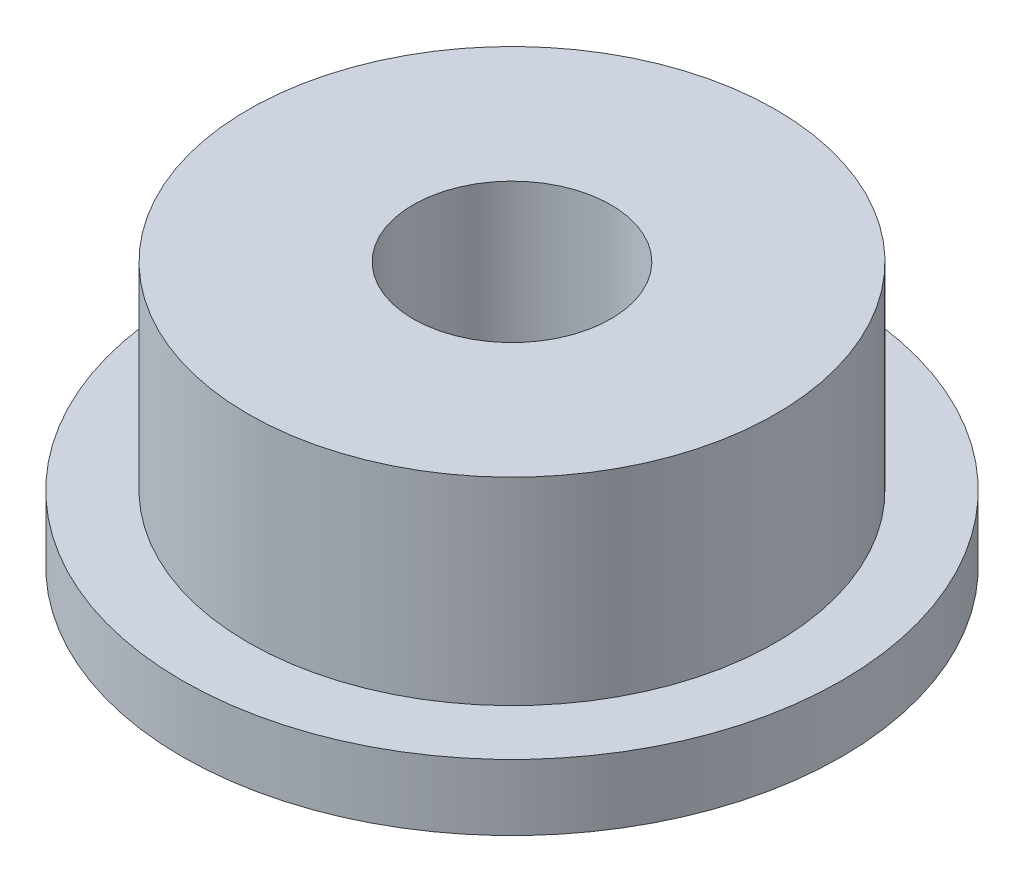
ISO-10303-21;
HEADER;
FILE_DESCRIPTION(('STEP AP214'),'2;1');
FILE_NAME('part.step','',(''),(''),'','','');
FILE_SCHEMA(('AUTOMOTIVE_DESIGN { 1 0 10303 214 1 1 1 1 }'));
ENDSEC;
DATA;
#1=APPLICATION_CONTEXT('core data for automotive mechanical design processes');
#2=APPLICATION_PROTOCOL_DEFINITION('international standard','automotive_design',2000,#1);
#3=PRODUCT_CONTEXT('',#1,'mechanical');
#4=PRODUCT('Part','Part','',(#3));
#5=PRODUCT_RELATED_PRODUCT_CATEGORY('part','',(#4));
#6=PRODUCT_DEFINITION_FORMATION('','',#4);
#7=PRODUCT_DEFINITION_CONTEXT('part definition',#1,'design');
#8=PRODUCT_DEFINITION('design','',#6,#7);
#9=PRODUCT_DEFINITION_SHAPE('','',#8);
#10=(LENGTH_UNIT() NAMED_UNIT(*) SI_UNIT(.MILLI.,.METRE.));
#11=(NAMED_UNIT(*) PLANE_ANGLE_UNIT() SI_UNIT($,.RADIAN.));
#12=(NAMED_UNIT(*) SI_UNIT($,.STERADIAN.) SOLID_ANGLE_UNIT());
#13=UNCERTAINTY_MEASURE_WITH_UNIT(LENGTH_MEASURE(1.E-05),#10,'distance_accuracy_value','');
#14=(GEOMETRIC_REPRESENTATION_CONTEXT(3) GLOBAL_UNCERTAINTY_ASSIGNED_CONTEXT((#13)) GLOBAL_UNIT_ASSIGNED_CONTEXT((#10,
#11,#12)) REPRESENTATION_CONTEXT('',''));
#15=CARTESIAN_POINT('',(0.,0.,0.));
#16=DIRECTION('',(0.,0.,1.));
#17=DIRECTION('',(1.,0.,0.));
#18=AXIS2_PLACEMENT_3D('',#15,#16,#17);
#19=CARTESIAN_POINT('',(1.5,0.,0.));
#20=DIRECTION('',(0.,-1.,0.));
#21=DIRECTION('',(0.,0.,-1.));
#22=AXIS2_PLACEMENT_3D('',#19,#20,#21);
#23=PLANE('',#22);
#24=CARTESIAN_POINT('',(0.,0.,0.));
#25=DIRECTION('',(0.,1.,0.));
#26=DIRECTION('',(0.,0.,1.));
#27=AXIS2_PLACEMENT_3D('',#24,#25,#26);
#28=CIRCLE('',#27,1.5);
#29=CARTESIAN_POINT('',(0.,0.,1.5));
#30=VERTEX_POINT('',#29);
#31=EDGE_CURVE('E67',#30,#30,#28,.T.);
#32=ORIENTED_EDGE('',*,*,#31,.F.);
#33=EDGE_LOOP('',(#32));
#34=FACE_BOUND('',#33,.T.);
#35=CARTESIAN_POINT('',(0.,0.,0.));
#36=DIRECTION('',(0.,1.,0.));
#37=DIRECTION('',(0.,0.,1.));
#38=AXIS2_PLACEMENT_3D('',#35,#36,#37);
#39=CIRCLE('',#38,4.);
#40=CARTESIAN_POINT('',(0.,0.,4.));
#41=VERTEX_POINT('',#40);
#42=EDGE_CURVE('E10',#41,#41,#39,.T.);
#43=ORIENTED_EDGE('',*,*,#42,.T.);
#44=EDGE_LOOP('',(#43));
#45=FACE_BOUND('',#44,.T.);
#46=ADVANCED_FACE('F39',(#34,#45),#23,.F.);
#47=CARTESIAN_POINT('',(0.,0.,0.));
#48=DIRECTION('',(0.,1.,0.));
#49=DIRECTION('',(0.,0.,1.));
#50=AXIS2_PLACEMENT_3D('',#47,#48,#49);
#51=CYLINDRICAL_SURFACE('',#50,4.);
#52=ORIENTED_EDGE('',*,*,#42,.F.);
#53=EDGE_LOOP('',(#52));
#54=FACE_BOUND('',#53,.T.);
#55=CARTESIAN_POINT('',(0.,-3.,0.));
#56=DIRECTION('',(0.,1.,0.));
#57=DIRECTION('',(0.,0.,1.));
#58=AXIS2_PLACEMENT_3D('',#55,#56,#57);
#59=CIRCLE('',#58,4.);
#60=CARTESIAN_POINT('',(0.,-3.,4.));
#61=VERTEX_POINT('',#60);
#62=EDGE_CURVE('E46',#61,#61,#59,.T.);
#63=ORIENTED_EDGE('',*,*,#62,.T.);
#64=EDGE_LOOP('',(#63));
#65=FACE_BOUND('',#64,.T.);
#66=ADVANCED_FACE('F74',(#54,#65),#51,.T.);
#67=CARTESIAN_POINT('',(4.,-3.,0.));
#68=DIRECTION('',(0.,-1.,0.));
#69=DIRECTION('',(0.,0.,-1.));
#70=AXIS2_PLACEMENT_3D('',#67,#68,#69);
#71=PLANE('',#70);
#72=ORIENTED_EDGE('',*,*,#62,.F.);
#73=EDGE_LOOP('',(#72));
#74=FACE_BOUND('',#73,.T.);
#75=CARTESIAN_POINT('',(0.,-3.,0.));
#76=DIRECTION('',(0.,1.,0.));
#77=DIRECTION('',(0.,0.,1.));
#78=AXIS2_PLACEMENT_3D('',#75,#76,#77);
#79=CIRCLE('',#78,5.);
#80=CARTESIAN_POINT('',(0.,-3.,5.));
#81=VERTEX_POINT('',#80);
#82=EDGE_CURVE('E53',#81,#81,#79,.T.);
#83=ORIENTED_EDGE('',*,*,#82,.T.);
#84=EDGE_LOOP('',(#83));
#85=FACE_BOUND('',#84,.T.);
#86=ADVANCED_FACE('F77',(#74,#85),#71,.F.);
#87=CARTESIAN_POINT('',(0.,0.,0.));
#88=DIRECTION('',(0.,1.,0.));
#89=DIRECTION('',(0.,0.,1.));
#90=AXIS2_PLACEMENT_3D('',#87,#88,#89);
#91=CYLINDRICAL_SURFACE('',#90,5.);
#92=ORIENTED_EDGE('',*,*,#82,.F.);
#93=EDGE_LOOP('',(#92));
#94=FACE_BOUND('',#93,.T.);
#95=CARTESIAN_POINT('',(0.,-4.,0.));
#96=DIRECTION('',(0.,1.,0.));
#97=DIRECTION('',(0.,0.,1.));
#98=AXIS2_PLACEMENT_3D('',#95,#96,#97);
#99=CIRCLE('',#98,5.);
#100=CARTESIAN_POINT('',(0.,-4.,5.));
#101=VERTEX_POINT('',#100);
#102=EDGE_CURVE('E59',#101,#101,#99,.T.);
#103=ORIENTED_EDGE('',*,*,#102,.T.);
#104=EDGE_LOOP('',(#103));
#105=FACE_BOUND('',#104,.T.);
#106=ADVANCED_FACE('F81',(#94,#105),#91,.T.);
#107=CARTESIAN_POINT('',(5.,-4.,0.));
#108=DIRECTION('',(0.,1.,0.));
#109=DIRECTION('',(0.,0.,1.));
#110=AXIS2_PLACEMENT_3D('',#107,#108,#109);
#111=PLANE('',#110);
#112=ORIENTED_EDGE('',*,*,#102,.F.);
#113=EDGE_LOOP('',(#112));
#114=FACE_BOUND('',#113,.T.);
#115=CARTESIAN_POINT('',(0.,-4.,0.));
#116=DIRECTION('',(0.,1.,0.));
#117=DIRECTION('',(0.,0.,1.));
#118=AXIS2_PLACEMENT_3D('',#115,#116,#117);
#119=CIRCLE('',#118,1.5);
#120=CARTESIAN_POINT('',(0.,-4.,1.5));
#121=VERTEX_POINT('',#120);
#122=EDGE_CURVE('E64',#121,#121,#119,.T.);
#123=ORIENTED_EDGE('',*,*,#122,.T.);
#124=EDGE_LOOP('',(#123));
#125=FACE_BOUND('',#124,.T.);
#126=ADVANCED_FACE('F87',(#114,#125),#111,.F.);
#127=CARTESIAN_POINT('',(0.,0.,0.));
#128=DIRECTION('',(0.,1.,0.));
#129=DIRECTION('',(0.,0.,1.));
#130=AXIS2_PLACEMENT_3D('',#127,#128,#129);
#131=CYLINDRICAL_SURFACE('',#130,1.5);
#132=ORIENTED_EDGE('',*,*,#122,.F.);
#133=EDGE_LOOP('',(#132));
#134=FACE_BOUND('',#133,.T.);
#135=ORIENTED_EDGE('',*,*,#31,.T.);
#136=EDGE_LOOP('',(#135));
#137=FACE_BOUND('',#136,.T.);
#138=ADVANCED_FACE('F71',(#134,#137),#131,.F.);
#139=CLOSED_SHELL('',(#46,#66,#86,#106,#126,#138));
#140=MANIFOLD_SOLID_BREP('B2',#139);
#141=ADVANCED_BREP_SHAPE_REPRESENTATION('',(#18,#140),#14);
#142=SHAPE_DEFINITION_REPRESENTATION(#9,#141);
ENDSEC;
END-ISO-10303-21;
